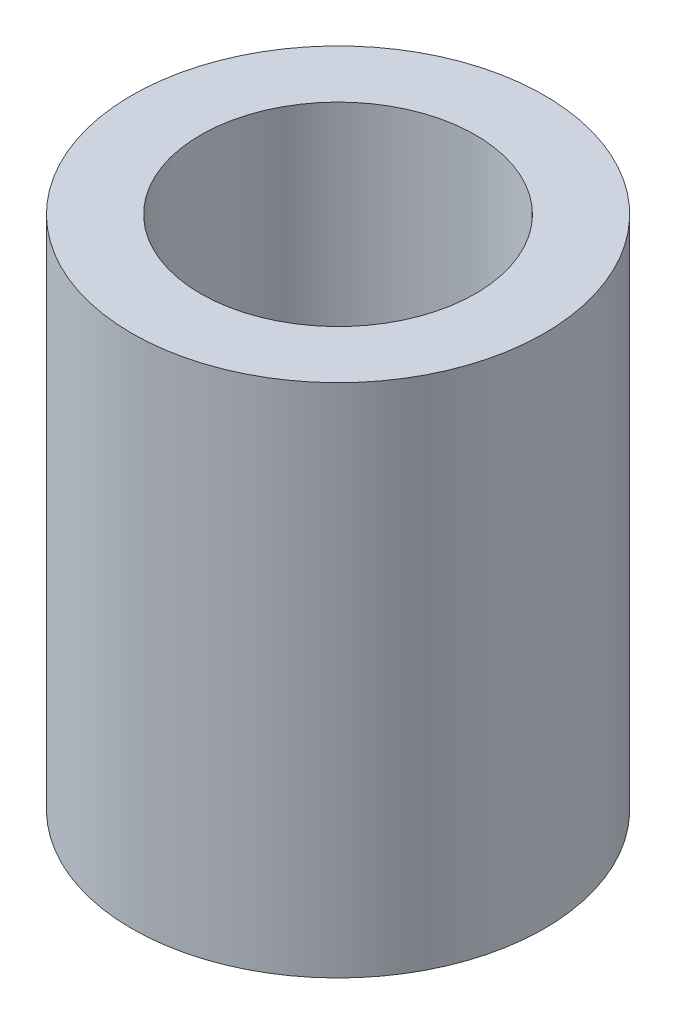
ISO-10303-21;
HEADER;
FILE_DESCRIPTION(('STEP AP214'),'2;1');
FILE_NAME('part.step','',(''),(''),'','','');
FILE_SCHEMA(('AUTOMOTIVE_DESIGN { 1 0 10303 214 1 1 1 1 }'));
ENDSEC;
DATA;
#1=APPLICATION_CONTEXT('core data for automotive mechanical design processes');
#2=APPLICATION_PROTOCOL_DEFINITION('international standard','automotive_design',2000,#1);
#3=PRODUCT_CONTEXT('',#1,'mechanical');
#4=PRODUCT('Part','Part','',(#3));
#5=PRODUCT_RELATED_PRODUCT_CATEGORY('part','',(#4));
#6=PRODUCT_DEFINITION_FORMATION('','',#4);
#7=PRODUCT_DEFINITION_CONTEXT('part definition',#1,'design');
#8=PRODUCT_DEFINITION('design','',#6,#7);
#9=PRODUCT_DEFINITION_SHAPE('','',#8);
#10=(LENGTH_UNIT() NAMED_UNIT(*) SI_UNIT(.MILLI.,.METRE.));
#11=(NAMED_UNIT(*) PLANE_ANGLE_UNIT() SI_UNIT($,.RADIAN.));
#12=(NAMED_UNIT(*) SI_UNIT($,.STERADIAN.) SOLID_ANGLE_UNIT());
#13=UNCERTAINTY_MEASURE_WITH_UNIT(LENGTH_MEASURE(1.E-05),#10,'distance_accuracy_value','');
#14=(GEOMETRIC_REPRESENTATION_CONTEXT(3) GLOBAL_UNCERTAINTY_ASSIGNED_CONTEXT((#13)) GLOBAL_UNIT_ASSIGNED_CONTEXT((#10,
#11,#12)) REPRESENTATION_CONTEXT('',''));
#15=CARTESIAN_POINT('',(0.,0.,0.));
#16=DIRECTION('',(0.,0.,1.));
#17=DIRECTION('',(1.,0.,0.));
#18=AXIS2_PLACEMENT_3D('',#15,#16,#17);
#19=CARTESIAN_POINT('',(0.,15.,0.));
#20=DIRECTION('',(0.,-1.,0.));
#21=DIRECTION('',(0.,0.,-1.));
#22=AXIS2_PLACEMENT_3D('',#19,#20,#21);
#23=CYLINDRICAL_SURFACE('',#22,6.);
#24=CARTESIAN_POINT('',(0.,15.,0.));
#25=DIRECTION('',(0.,1.,0.));
#26=DIRECTION('',(0.,0.,1.));
#27=AXIS2_PLACEMENT_3D('',#24,#25,#26);
#28=CIRCLE('',#27,6.);
#29=CARTESIAN_POINT('',(0.,15.,6.));
#30=VERTEX_POINT('',#29);
#31=EDGE_CURVE('E10',#30,#30,#28,.T.);
#32=ORIENTED_EDGE('',*,*,#31,.F.);
#33=EDGE_LOOP('',(#32));
#34=FACE_BOUND('',#33,.T.);
#35=CARTESIAN_POINT('',(0.,0.,0.));
#36=DIRECTION('',(0.,1.,0.));
#37=DIRECTION('',(0.,0.,1.));
#38=AXIS2_PLACEMENT_3D('',#35,#36,#37);
#39=CIRCLE('',#38,6.);
#40=CARTESIAN_POINT('',(0.,0.,6.));
#41=VERTEX_POINT('',#40);
#42=EDGE_CURVE('E35',#41,#41,#39,.T.);
#43=ORIENTED_EDGE('',*,*,#42,.T.);
#44=EDGE_LOOP('',(#43));
#45=FACE_BOUND('',#44,.T.);
#46=ADVANCED_FACE('F32',(#34,#45),#23,.T.);
#47=CARTESIAN_POINT('',(0.,15.,0.));
#48=DIRECTION('',(0.,1.,0.));
#49=DIRECTION('',(0.,0.,1.));
#50=AXIS2_PLACEMENT_3D('',#47,#48,#49);
#51=PLANE('',#50);
#52=CARTESIAN_POINT('',(0.,15.,0.));
#53=DIRECTION('',(0.,1.,0.));
#54=DIRECTION('',(0.,0.,1.));
#55=AXIS2_PLACEMENT_3D('',#52,#53,#54);
#56=CIRCLE('',#55,4.);
#57=CARTESIAN_POINT('',(0.,15.,4.));
#58=VERTEX_POINT('',#57);
#59=EDGE_CURVE('E50',#58,#58,#56,.T.);
#60=ORIENTED_EDGE('',*,*,#59,.F.);
#61=EDGE_LOOP('',(#60));
#62=FACE_BOUND('',#61,.T.);
#63=ORIENTED_EDGE('',*,*,#31,.T.);
#64=EDGE_LOOP('',(#63));
#65=FACE_BOUND('',#64,.T.);
#66=ADVANCED_FACE('F65',(#62,#65),#51,.T.);
#67=CARTESIAN_POINT('',(0.,0.,0.));
#68=DIRECTION('',(0.,1.,0.));
#69=DIRECTION('',(0.,0.,1.));
#70=AXIS2_PLACEMENT_3D('',#67,#68,#69);
#71=PLANE('',#70);
#72=CARTESIAN_POINT('',(0.,0.,0.));
#73=DIRECTION('',(0.,-1.,0.));
#74=DIRECTION('',(0.,0.,-1.));
#75=AXIS2_PLACEMENT_3D('',#72,#73,#74);
#76=CIRCLE('',#75,3.);
#77=CARTESIAN_POINT('',(0.,0.,-3.));
#78=VERTEX_POINT('',#77);
#79=EDGE_CURVE('E44',#78,#78,#76,.T.);
#80=ORIENTED_EDGE('',*,*,#79,.F.);
#81=EDGE_LOOP('',(#80));
#82=FACE_BOUND('',#81,.T.);
#83=ORIENTED_EDGE('',*,*,#42,.F.);
#84=EDGE_LOOP('',(#83));
#85=FACE_BOUND('',#84,.T.);
#86=ADVANCED_FACE('F67',(#82,#85),#71,.F.);
#87=CARTESIAN_POINT('',(0.,7.,0.));
#88=DIRECTION('',(0.,-1.,0.));
#89=DIRECTION('',(0.,0.,-1.));
#90=AXIS2_PLACEMENT_3D('',#87,#88,#89);
#91=CYLINDRICAL_SURFACE('',#90,3.);
#92=CARTESIAN_POINT('',(0.,7.,0.));
#93=DIRECTION('',(0.,-1.,0.));
#94=DIRECTION('',(0.,0.,-1.));
#95=AXIS2_PLACEMENT_3D('',#92,#93,#94);
#96=CIRCLE('',#95,3.);
#97=CARTESIAN_POINT('',(0.,7.,-3.));
#98=VERTEX_POINT('',#97);
#99=EDGE_CURVE('E42',#98,#98,#96,.T.);
#100=ORIENTED_EDGE('',*,*,#99,.F.);
#101=EDGE_LOOP('',(#100));
#102=FACE_BOUND('',#101,.T.);
#103=ORIENTED_EDGE('',*,*,#79,.T.);
#104=EDGE_LOOP('',(#103));
#105=FACE_BOUND('',#104,.T.);
#106=ADVANCED_FACE('F73',(#102,#105),#91,.F.);
#107=CARTESIAN_POINT('',(0.,7.,0.));
#108=DIRECTION('',(0.,-1.,0.));
#109=DIRECTION('',(0.,0.,-1.));
#110=AXIS2_PLACEMENT_3D('',#107,#108,#109);
#111=PLANE('',#110);
#112=ORIENTED_EDGE('',*,*,#99,.T.);
#113=EDGE_LOOP('',(#112));
#114=FACE_BOUND('',#113,.T.);
#115=ADVANCED_FACE('F61',(#114),#111,.T.);
#116=CARTESIAN_POINT('',(0.,8.,0.));
#117=DIRECTION('',(0.,1.,0.));
#118=DIRECTION('',(0.,0.,1.));
#119=AXIS2_PLACEMENT_3D('',#116,#117,#118);
#120=CYLINDRICAL_SURFACE('',#119,4.);
#121=CARTESIAN_POINT('',(0.,8.,0.));
#122=DIRECTION('',(0.,1.,0.));
#123=DIRECTION('',(0.,0.,1.));
#124=AXIS2_PLACEMENT_3D('',#121,#122,#123);
#125=CIRCLE('',#124,4.);
#126=CARTESIAN_POINT('',(0.,8.,4.));
#127=VERTEX_POINT('',#126);
#128=EDGE_CURVE('E47',#127,#127,#125,.T.);
#129=ORIENTED_EDGE('',*,*,#128,.F.);
#130=EDGE_LOOP('',(#129));
#131=FACE_BOUND('',#130,.T.);
#132=ORIENTED_EDGE('',*,*,#59,.T.);
#133=EDGE_LOOP('',(#132));
#134=FACE_BOUND('',#133,.T.);
#135=ADVANCED_FACE('F58',(#131,#134),#120,.F.);
#136=CARTESIAN_POINT('',(0.,8.,0.));
#137=DIRECTION('',(0.,1.,0.));
#138=DIRECTION('',(0.,0.,1.));
#139=AXIS2_PLACEMENT_3D('',#136,#137,#138);
#140=PLANE('',#139);
#141=ORIENTED_EDGE('',*,*,#128,.T.);
#142=EDGE_LOOP('',(#141));
#143=FACE_BOUND('',#142,.T.);
#144=ADVANCED_FACE('F56',(#143),#140,.T.);
#145=CLOSED_SHELL('',(#46,#66,#86,#106,#115,#135,#144));
#146=MANIFOLD_SOLID_BREP('B2',#145);
#147=ADVANCED_BREP_SHAPE_REPRESENTATION('',(#18,#146),#14);
#148=SHAPE_DEFINITION_REPRESENTATION(#9,#147);
ENDSEC;
END-ISO-10303-21;
